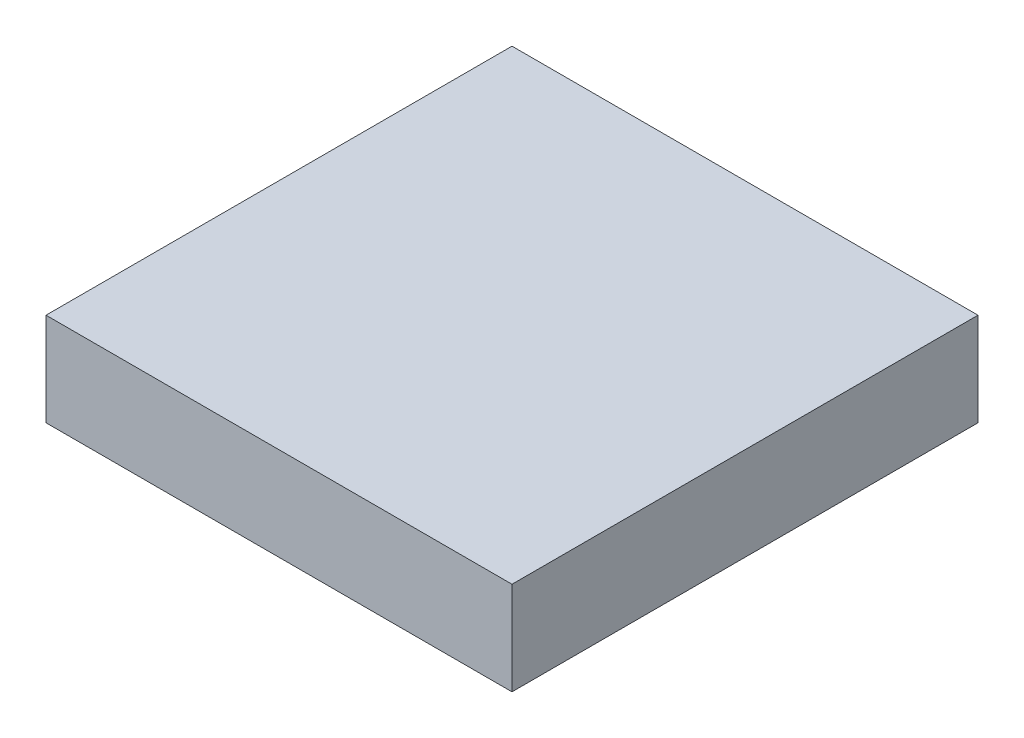
ISO-10303-21;
HEADER;
FILE_DESCRIPTION(('STEP AP214'),'2;1');
FILE_NAME('part.step','',(''),(''),'','','');
FILE_SCHEMA(('AUTOMOTIVE_DESIGN { 1 0 10303 214 1 1 1 1 }'));
ENDSEC;
DATA;
#1=APPLICATION_CONTEXT('core data for automotive mechanical design processes');
#2=APPLICATION_PROTOCOL_DEFINITION('international standard','automotive_design',2000,#1);
#3=PRODUCT_CONTEXT('',#1,'mechanical');
#4=PRODUCT('Part','Part','',(#3));
#5=PRODUCT_RELATED_PRODUCT_CATEGORY('part','',(#4));
#6=PRODUCT_DEFINITION_FORMATION('','',#4);
#7=PRODUCT_DEFINITION_CONTEXT('part definition',#1,'design');
#8=PRODUCT_DEFINITION('design','',#6,#7);
#9=PRODUCT_DEFINITION_SHAPE('','',#8);
#10=(LENGTH_UNIT() NAMED_UNIT(*) SI_UNIT(.MILLI.,.METRE.));
#11=(NAMED_UNIT(*) PLANE_ANGLE_UNIT() SI_UNIT($,.RADIAN.));
#12=(NAMED_UNIT(*) SI_UNIT($,.STERADIAN.) SOLID_ANGLE_UNIT());
#13=UNCERTAINTY_MEASURE_WITH_UNIT(LENGTH_MEASURE(1.E-05),#10,'distance_accuracy_value','');
#14=(GEOMETRIC_REPRESENTATION_CONTEXT(3) GLOBAL_UNCERTAINTY_ASSIGNED_CONTEXT((#13)) GLOBAL_UNIT_ASSIGNED_CONTEXT((#10,
#11,#12)) REPRESENTATION_CONTEXT('',''));
#15=CARTESIAN_POINT('',(0.,0.,0.));
#16=DIRECTION('',(0.,0.,1.));
#17=DIRECTION('',(1.,0.,0.));
#18=AXIS2_PLACEMENT_3D('',#15,#16,#17);
#19=CARTESIAN_POINT('',(0.,-5.,0.));
#20=DIRECTION('',(0.,1.,0.));
#21=DIRECTION('',(0.,0.,1.));
#22=AXIS2_PLACEMENT_3D('',#19,#20,#21);
#23=PLANE('',#22);
#24=CARTESIAN_POINT('',(0.,-5.,0.));
#25=DIRECTION('',(0.,1.,0.));
#26=DIRECTION('',(0.,0.,1.));
#27=AXIS2_PLACEMENT_3D('',#24,#25,#26);
#28=CIRCLE('',#27,2.7);
#29=CARTESIAN_POINT('',(-2.0976176963403,-5.,-1.7));
#30=VERTEX_POINT('',#29);
#31=CARTESIAN_POINT('',(-2.5,-5.,-1.01980390271856));
#32=VERTEX_POINT('',#31);
#33=EDGE_CURVE('E162',#30,#32,#28,.T.);
#34=ORIENTED_EDGE('',*,*,#33,.T.);
#35=DIRECTION('',(0.,0.,-1.));
#36=VECTOR('',#35,1.);
#37=CARTESIAN_POINT('',(-2.5,-5.,0.));
#38=LINE('',#37,#36);
#39=CARTESIAN_POINT('',(-2.5,-5.,-2.5));
#40=VERTEX_POINT('',#39);
#41=EDGE_CURVE('E200',#32,#40,#38,.T.);
#42=ORIENTED_EDGE('',*,*,#41,.T.);
#43=DIRECTION('',(1.,0.,0.));
#44=VECTOR('',#43,1.);
#45=CARTESIAN_POINT('',(7.5,-5.,-2.5));
#46=LINE('',#45,#44);
#47=CARTESIAN_POINT('',(2.5,-5.,-2.5));
#48=VERTEX_POINT('',#47);
#49=EDGE_CURVE('E198',#40,#48,#46,.T.);
#50=ORIENTED_EDGE('',*,*,#49,.T.);
#51=DIRECTION('',(0.,0.,1.));
#52=VECTOR('',#51,1.);
#53=CARTESIAN_POINT('',(2.5,-5.,7.5));
#54=LINE('',#53,#52);
#55=CARTESIAN_POINT('',(2.5,-5.,-1.01980390271856));
#56=VERTEX_POINT('',#55);
#57=EDGE_CURVE('E196',#48,#56,#54,.T.);
#58=ORIENTED_EDGE('',*,*,#57,.T.);
#59=CARTESIAN_POINT('',(2.0976176963403,-5.,-1.7));
#60=VERTEX_POINT('',#59);
#61=EDGE_CURVE('E160',#56,#60,#28,.T.);
#62=ORIENTED_EDGE('',*,*,#61,.T.);
#63=DIRECTION('',(1.,0.,0.));
#64=VECTOR('',#63,1.);
#65=CARTESIAN_POINT('',(0.,-5.,-1.7));
#66=LINE('',#65,#64);
#67=EDGE_CURVE('E164',#30,#60,#66,.T.);
#68=ORIENTED_EDGE('',*,*,#67,.F.);
#69=EDGE_LOOP('',(#34,#42,#50,#58,#62,#68));
#70=FACE_BOUND('',#69,.T.);
#71=ADVANCED_FACE('F38',(#70),#23,.F.);
#72=CARTESIAN_POINT('',(-7.5,-5.,0.));
#73=DIRECTION('',(1.,0.,0.));
#74=DIRECTION('',(0.,0.,-1.));
#75=AXIS2_PLACEMENT_3D('',#72,#73,#74);
#76=PLANE('',#75);
#77=DIRECTION('',(0.,1.,0.));
#78=VECTOR('',#77,1.);
#79=CARTESIAN_POINT('',(-7.5,-5.,-7.5));
#80=LINE('',#79,#78);
#81=CARTESIAN_POINT('',(-7.5,0.,-7.5));
#82=VERTEX_POINT('',#81);
#83=CARTESIAN_POINT('',(-7.5,3.,-7.5));
#84=VERTEX_POINT('',#83);
#85=EDGE_CURVE('E175',#82,#84,#80,.T.);
#86=ORIENTED_EDGE('',*,*,#85,.F.);
#87=DIRECTION('',(0.,0.,1.));
#88=VECTOR('',#87,1.);
#89=CARTESIAN_POINT('',(-7.5,0.,0.));
#90=LINE('',#89,#88);
#91=CARTESIAN_POINT('',(-7.5,0.,7.5));
#92=VERTEX_POINT('',#91);
#93=EDGE_CURVE('E134',#82,#92,#90,.T.);
#94=ORIENTED_EDGE('',*,*,#93,.T.);
#95=DIRECTION('',(0.,1.,0.));
#96=VECTOR('',#95,1.);
#97=CARTESIAN_POINT('',(-7.5,-5.,7.5));
#98=LINE('',#97,#96);
#99=CARTESIAN_POINT('',(-7.5,3.,7.5));
#100=VERTEX_POINT('',#99);
#101=EDGE_CURVE('E128',#92,#100,#98,.T.);
#102=ORIENTED_EDGE('',*,*,#101,.T.);
#103=DIRECTION('',(0.,0.,-1.));
#104=VECTOR('',#103,1.);
#105=CARTESIAN_POINT('',(-7.5,3.,0.));
#106=LINE('',#105,#104);
#107=EDGE_CURVE('E132',#100,#84,#106,.T.);
#108=ORIENTED_EDGE('',*,*,#107,.T.);
#109=EDGE_LOOP('',(#86,#94,#102,#108));
#110=FACE_BOUND('',#109,.T.);
#111=ADVANCED_FACE('F131',(#110),#76,.F.);
#112=CARTESIAN_POINT('',(0.,-5.,-7.5));
#113=DIRECTION('',(0.,0.,-1.));
#114=DIRECTION('',(-1.,0.,0.));
#115=AXIS2_PLACEMENT_3D('',#112,#113,#114);
#116=PLANE('',#115);
#117=DIRECTION('',(0.,1.,0.));
#118=VECTOR('',#117,1.);
#119=CARTESIAN_POINT('',(7.5,-5.,-7.5));
#120=LINE('',#119,#118);
#121=CARTESIAN_POINT('',(7.5,0.,-7.5));
#122=VERTEX_POINT('',#121);
#123=CARTESIAN_POINT('',(7.5,3.,-7.5));
#124=VERTEX_POINT('',#123);
#125=EDGE_CURVE('E178',#122,#124,#120,.T.);
#126=ORIENTED_EDGE('',*,*,#125,.F.);
#127=DIRECTION('',(-1.,0.,0.));
#128=VECTOR('',#127,1.);
#129=CARTESIAN_POINT('',(-7.5,0.,-7.5));
#130=LINE('',#129,#128);
#131=EDGE_CURVE('E205',#122,#82,#130,.T.);
#132=ORIENTED_EDGE('',*,*,#131,.T.);
#133=ORIENTED_EDGE('',*,*,#85,.T.);
#134=DIRECTION('',(-1.,0.,0.));
#135=VECTOR('',#134,1.);
#136=CARTESIAN_POINT('',(0.,3.,-7.5));
#137=LINE('',#136,#135);
#138=EDGE_CURVE('E146',#124,#84,#137,.T.);
#139=ORIENTED_EDGE('',*,*,#138,.F.);
#140=EDGE_LOOP('',(#126,#132,#133,#139));
#141=FACE_BOUND('',#140,.T.);
#142=ADVANCED_FACE('F232',(#141),#116,.T.);
#143=CARTESIAN_POINT('',(7.5,-5.,0.));
#144=DIRECTION('',(1.,0.,0.));
#145=DIRECTION('',(0.,0.,-1.));
#146=AXIS2_PLACEMENT_3D('',#143,#144,#145);
#147=PLANE('',#146);
#148=DIRECTION('',(0.,1.,0.));
#149=VECTOR('',#148,1.);
#150=CARTESIAN_POINT('',(7.5,-5.,7.5));
#151=LINE('',#150,#149);
#152=CARTESIAN_POINT('',(7.5,0.,7.5));
#153=VERTEX_POINT('',#152);
#154=CARTESIAN_POINT('',(7.5,3.,7.5));
#155=VERTEX_POINT('',#154);
#156=EDGE_CURVE('E136',#153,#155,#151,.T.);
#157=ORIENTED_EDGE('',*,*,#156,.F.);
#158=DIRECTION('',(0.,0.,-1.));
#159=VECTOR('',#158,1.);
#160=CARTESIAN_POINT('',(7.5,0.,-7.5));
#161=LINE('',#160,#159);
#162=EDGE_CURVE('E60',#153,#122,#161,.T.);
#163=ORIENTED_EDGE('',*,*,#162,.T.);
#164=ORIENTED_EDGE('',*,*,#125,.T.);
#165=DIRECTION('',(0.,0.,-1.));
#166=VECTOR('',#165,1.);
#167=CARTESIAN_POINT('',(7.5,3.,0.));
#168=LINE('',#167,#166);
#169=EDGE_CURVE('E150',#155,#124,#168,.T.);
#170=ORIENTED_EDGE('',*,*,#169,.F.);
#171=EDGE_LOOP('',(#157,#163,#164,#170));
#172=FACE_BOUND('',#171,.T.);
#173=ADVANCED_FACE('F279',(#172),#147,.T.);
#174=CARTESIAN_POINT('',(0.,-5.,0.));
#175=DIRECTION('',(0.,1.,0.));
#176=DIRECTION('',(0.,0.,1.));
#177=AXIS2_PLACEMENT_3D('',#174,#175,#176);
#178=CYLINDRICAL_SURFACE('',#177,2.7);
#179=ORIENTED_EDGE('',*,*,#61,.F.);
#180=CARTESIAN_POINT('',(0.,-7.50000000000001,0.));
#181=DIRECTION('',(0.707106781186549,-0.707106781186546,0.));
#182=DIRECTION('',(0.707106781186546,0.707106781186549,0.));
#183=AXIS2_PLACEMENT_3D('',#180,#181,#182);
#184=ELLIPSE('',#183,3.81837661840736,2.7);
#185=CARTESIAN_POINT('',(2.5,-5.,1.01980390271856));
#186=VERTEX_POINT('',#185);
#187=EDGE_CURVE('E47',#56,#186,#184,.T.);
#188=ORIENTED_EDGE('',*,*,#187,.T.);
#189=CARTESIAN_POINT('',(2.0976176963403,-5.,1.7));
#190=VERTEX_POINT('',#189);
#191=EDGE_CURVE('E156',#190,#186,#28,.T.);
#192=ORIENTED_EDGE('',*,*,#191,.F.);
#193=DIRECTION('',(0.,1.,0.));
#194=VECTOR('',#193,1.);
#195=CARTESIAN_POINT('',(2.0976176963403,-5.,1.7));
#196=LINE('',#195,#194);
#197=CARTESIAN_POINT('',(2.0976176963403,0.,1.7));
#198=VERTEX_POINT('',#197);
#199=EDGE_CURVE('E167',#190,#198,#196,.T.);
#200=ORIENTED_EDGE('',*,*,#199,.T.);
#201=CARTESIAN_POINT('',(0.,0.,0.));
#202=DIRECTION('',(0.,1.,0.));
#203=DIRECTION('',(0.,0.,1.));
#204=AXIS2_PLACEMENT_3D('',#201,#202,#203);
#205=CIRCLE('',#204,2.7);
#206=CARTESIAN_POINT('',(2.0976176963403,0.,-1.7));
#207=VERTEX_POINT('',#206);
#208=EDGE_CURVE('E155',#198,#207,#205,.T.);
#209=ORIENTED_EDGE('',*,*,#208,.T.);
#210=DIRECTION('',(0.,1.,0.));
#211=VECTOR('',#210,1.);
#212=CARTESIAN_POINT('',(2.0976176963403,-5.,-1.7));
#213=LINE('',#212,#211);
#214=EDGE_CURVE('E137',#60,#207,#213,.T.);
#215=ORIENTED_EDGE('',*,*,#214,.F.);
#216=EDGE_LOOP('',(#179,#188,#192,#200,#209,#215));
#217=FACE_BOUND('',#216,.T.);
#218=ADVANCED_FACE('F251',(#217),#178,.F.);
#219=CARTESIAN_POINT('',(0.,-5.,-1.7));
#220=DIRECTION('',(0.,0.,1.));
#221=DIRECTION('',(1.,0.,0.));
#222=AXIS2_PLACEMENT_3D('',#219,#220,#221);
#223=PLANE('',#222);
#224=DIRECTION('',(1.,0.,0.));
#225=VECTOR('',#224,1.);
#226=CARTESIAN_POINT('',(0.,0.,-1.7));
#227=LINE('',#226,#225);
#228=CARTESIAN_POINT('',(-2.0976176963403,0.,-1.7));
#229=VERTEX_POINT('',#228);
#230=EDGE_CURVE('E172',#229,#207,#227,.T.);
#231=ORIENTED_EDGE('',*,*,#230,.F.);
#232=DIRECTION('',(0.,1.,0.));
#233=VECTOR('',#232,1.);
#234=CARTESIAN_POINT('',(-2.0976176963403,-5.,-1.7));
#235=LINE('',#234,#233);
#236=EDGE_CURVE('E183',#30,#229,#235,.T.);
#237=ORIENTED_EDGE('',*,*,#236,.F.);
#238=ORIENTED_EDGE('',*,*,#67,.T.);
#239=ORIENTED_EDGE('',*,*,#214,.T.);
#240=EDGE_LOOP('',(#231,#237,#238,#239));
#241=FACE_BOUND('',#240,.T.);
#242=ADVANCED_FACE('F255',(#241),#223,.T.);
#243=CARTESIAN_POINT('',(-2.5,-5.,1.01980390271856));
#244=VERTEX_POINT('',#243);
#245=CARTESIAN_POINT('',(-2.0976176963403,-5.,1.7));
#246=VERTEX_POINT('',#245);
#247=EDGE_CURVE('E161',#244,#246,#28,.T.);
#248=ORIENTED_EDGE('',*,*,#247,.F.);
#249=CARTESIAN_POINT('',(0.,-7.50000000000001,0.));
#250=DIRECTION('',(0.707106781186549,0.707106781186546,0.));
#251=DIRECTION('',(-0.707106781186546,0.707106781186549,0.));
#252=AXIS2_PLACEMENT_3D('',#249,#250,#251);
#253=ELLIPSE('',#252,3.81837661840736,2.7);
#254=EDGE_CURVE('E202',#244,#32,#253,.F.);
#255=ORIENTED_EDGE('',*,*,#254,.T.);
#256=ORIENTED_EDGE('',*,*,#33,.F.);
#257=ORIENTED_EDGE('',*,*,#236,.T.);
#258=CARTESIAN_POINT('',(-2.0976176963403,0.,1.7));
#259=VERTEX_POINT('',#258);
#260=EDGE_CURVE('E170',#229,#259,#205,.T.);
#261=ORIENTED_EDGE('',*,*,#260,.T.);
#262=DIRECTION('',(0.,1.,0.));
#263=VECTOR('',#262,1.);
#264=CARTESIAN_POINT('',(-2.0976176963403,-5.,1.7));
#265=LINE('',#264,#263);
#266=EDGE_CURVE('E185',#246,#259,#265,.T.);
#267=ORIENTED_EDGE('',*,*,#266,.F.);
#268=EDGE_LOOP('',(#248,#255,#256,#257,#261,#267));
#269=FACE_BOUND('',#268,.T.);
#270=ADVANCED_FACE('F242',(#269),#178,.F.);
#271=CARTESIAN_POINT('',(0.,-5.,1.7));
#272=DIRECTION('',(0.,0.,1.));
#273=DIRECTION('',(1.,0.,0.));
#274=AXIS2_PLACEMENT_3D('',#271,#272,#273);
#275=PLANE('',#274);
#276=DIRECTION('',(1.,0.,0.));
#277=VECTOR('',#276,1.);
#278=CARTESIAN_POINT('',(0.,0.,1.7));
#279=LINE('',#278,#277);
#280=EDGE_CURVE('E169',#259,#198,#279,.T.);
#281=ORIENTED_EDGE('',*,*,#280,.T.);
#282=ORIENTED_EDGE('',*,*,#199,.F.);
#283=DIRECTION('',(1.,0.,0.));
#284=VECTOR('',#283,1.);
#285=CARTESIAN_POINT('',(0.,-5.,1.7));
#286=LINE('',#285,#284);
#287=EDGE_CURVE('E159',#246,#190,#286,.T.);
#288=ORIENTED_EDGE('',*,*,#287,.F.);
#289=ORIENTED_EDGE('',*,*,#266,.T.);
#290=EDGE_LOOP('',(#281,#282,#288,#289));
#291=FACE_BOUND('',#290,.T.);
#292=ADVANCED_FACE('F260',(#291),#275,.F.);
#293=CARTESIAN_POINT('',(0.,-5.,7.5));
#294=DIRECTION('',(0.,0.,-1.));
#295=DIRECTION('',(-1.,0.,0.));
#296=AXIS2_PLACEMENT_3D('',#293,#294,#295);
#297=PLANE('',#296);
#298=ORIENTED_EDGE('',*,*,#101,.F.);
#299=DIRECTION('',(1.,0.,0.));
#300=VECTOR('',#299,1.);
#301=CARTESIAN_POINT('',(0.,0.,7.5));
#302=LINE('',#301,#300);
#303=EDGE_CURVE('E11',#92,#153,#302,.T.);
#304=ORIENTED_EDGE('',*,*,#303,.T.);
#305=ORIENTED_EDGE('',*,*,#156,.T.);
#306=DIRECTION('',(-1.,0.,0.));
#307=VECTOR('',#306,1.);
#308=CARTESIAN_POINT('',(0.,3.,7.5));
#309=LINE('',#308,#307);
#310=EDGE_CURVE('E144',#155,#100,#309,.T.);
#311=ORIENTED_EDGE('',*,*,#310,.T.);
#312=EDGE_LOOP('',(#298,#304,#305,#311));
#313=FACE_BOUND('',#312,.T.);
#314=ADVANCED_FACE('F148',(#313),#297,.F.);
#315=DIRECTION('',(-1.,0.,0.));
#316=VECTOR('',#315,1.);
#317=CARTESIAN_POINT('',(0.,-5.,2.5));
#318=LINE('',#317,#316);
#319=CARTESIAN_POINT('',(2.5,-5.,2.5));
#320=VERTEX_POINT('',#319);
#321=CARTESIAN_POINT('',(-2.5,-5.,2.5));
#322=VERTEX_POINT('',#321);
#323=EDGE_CURVE('E177',#320,#322,#318,.T.);
#324=ORIENTED_EDGE('',*,*,#323,.T.);
#325=DIRECTION('',(0.,0.,-1.));
#326=VECTOR('',#325,1.);
#327=CARTESIAN_POINT('',(-2.5,-5.,0.));
#328=LINE('',#327,#326);
#329=EDGE_CURVE('E193',#322,#244,#328,.T.);
#330=ORIENTED_EDGE('',*,*,#329,.T.);
#331=ORIENTED_EDGE('',*,*,#247,.T.);
#332=ORIENTED_EDGE('',*,*,#287,.T.);
#333=ORIENTED_EDGE('',*,*,#191,.T.);
#334=DIRECTION('',(0.,0.,1.));
#335=VECTOR('',#334,1.);
#336=CARTESIAN_POINT('',(2.5,-5.,7.5));
#337=LINE('',#336,#335);
#338=EDGE_CURVE('E191',#186,#320,#337,.T.);
#339=ORIENTED_EDGE('',*,*,#338,.T.);
#340=EDGE_LOOP('',(#324,#330,#331,#332,#333,#339));
#341=FACE_BOUND('',#340,.T.);
#342=ADVANCED_FACE('F239',(#341),#23,.F.);
#343=CARTESIAN_POINT('',(0.,0.,0.));
#344=DIRECTION('',(0.,1.,0.));
#345=DIRECTION('',(0.,0.,1.));
#346=AXIS2_PLACEMENT_3D('',#343,#344,#345);
#347=PLANE('',#346);
#348=ORIENTED_EDGE('',*,*,#208,.F.);
#349=ORIENTED_EDGE('',*,*,#280,.F.);
#350=ORIENTED_EDGE('',*,*,#260,.F.);
#351=ORIENTED_EDGE('',*,*,#230,.T.);
#352=EDGE_LOOP('',(#348,#349,#350,#351));
#353=FACE_BOUND('',#352,.T.);
#354=ADVANCED_FACE('F262',(#353),#347,.F.);
#355=CARTESIAN_POINT('',(0.,3.,0.));
#356=DIRECTION('',(0.,1.,0.));
#357=DIRECTION('',(0.,0.,1.));
#358=AXIS2_PLACEMENT_3D('',#355,#356,#357);
#359=PLANE('',#358);
#360=ORIENTED_EDGE('',*,*,#107,.F.);
#361=ORIENTED_EDGE('',*,*,#310,.F.);
#362=ORIENTED_EDGE('',*,*,#169,.T.);
#363=ORIENTED_EDGE('',*,*,#138,.T.);
#364=EDGE_LOOP('',(#360,#361,#362,#363));
#365=FACE_BOUND('',#364,.T.);
#366=ADVANCED_FACE('F142',(#365),#359,.T.);
#367=CARTESIAN_POINT('',(7.5,0.,0.));
#368=DIRECTION('',(0.707106781186549,-0.707106781186546,0.));
#369=DIRECTION('',(0.,0.,1.));
#370=AXIS2_PLACEMENT_3D('',#367,#368,#369);
#371=PLANE('',#370);
#372=DIRECTION('',(0.577350269189625,0.577350269189627,-0.577350269189625));
#373=VECTOR('',#372,1.);
#374=CARTESIAN_POINT('',(5.,-2.49999999999998,-5.00000000000001));
#375=LINE('',#374,#373);
#376=EDGE_CURVE('E213',#122,#48,#375,.F.);
#377=ORIENTED_EDGE('',*,*,#376,.F.);
#378=ORIENTED_EDGE('',*,*,#162,.F.);
#379=DIRECTION('',(-0.577350269189625,-0.577350269189627,-0.577350269189625));
#380=VECTOR('',#379,1.);
#381=CARTESIAN_POINT('',(1.66666666666667,-5.83333333333333,1.66666666666667));
#382=LINE('',#381,#380);
#383=EDGE_CURVE('E42',#320,#153,#382,.F.);
#384=ORIENTED_EDGE('',*,*,#383,.F.);
#385=ORIENTED_EDGE('',*,*,#338,.F.);
#386=ORIENTED_EDGE('',*,*,#187,.F.);
#387=ORIENTED_EDGE('',*,*,#57,.F.);
#388=EDGE_LOOP('',(#377,#378,#384,#385,#386,#387));
#389=FACE_BOUND('',#388,.T.);
#390=ADVANCED_FACE('F40',(#389),#371,.T.);
#391=CARTESIAN_POINT('',(0.,-5.,2.5));
#392=DIRECTION('',(0.,0.707106781186546,-0.707106781186549));
#393=DIRECTION('',(-1.,0.,0.));
#394=AXIS2_PLACEMENT_3D('',#391,#392,#393);
#395=PLANE('',#394);
#396=ORIENTED_EDGE('',*,*,#383,.T.);
#397=ORIENTED_EDGE('',*,*,#303,.F.);
#398=DIRECTION('',(0.577350269189625,-0.577350269189627,-0.577350269189625));
#399=VECTOR('',#398,1.);
#400=CARTESIAN_POINT('',(-1.66666666666667,-5.83333333333333,1.66666666666667));
#401=LINE('',#400,#399);
#402=EDGE_CURVE('E212',#322,#92,#401,.F.);
#403=ORIENTED_EDGE('',*,*,#402,.F.);
#404=ORIENTED_EDGE('',*,*,#323,.F.);
#405=EDGE_LOOP('',(#396,#397,#403,#404));
#406=FACE_BOUND('',#405,.T.);
#407=ADVANCED_FACE('F223',(#406),#395,.F.);
#408=CARTESIAN_POINT('',(0.,0.,-7.5));
#409=DIRECTION('',(0.,-0.707106781186546,-0.707106781186549));
#410=DIRECTION('',(1.,0.,0.));
#411=AXIS2_PLACEMENT_3D('',#408,#409,#410);
#412=PLANE('',#411);
#413=ORIENTED_EDGE('',*,*,#376,.T.);
#414=ORIENTED_EDGE('',*,*,#49,.F.);
#415=DIRECTION('',(0.577350269189625,-0.577350269189627,0.577350269189625));
#416=VECTOR('',#415,1.);
#417=CARTESIAN_POINT('',(-5.00000000000001,-2.49999999999998,-5.));
#418=LINE('',#417,#416);
#419=EDGE_CURVE('E209',#82,#40,#418,.T.);
#420=ORIENTED_EDGE('',*,*,#419,.F.);
#421=ORIENTED_EDGE('',*,*,#131,.F.);
#422=EDGE_LOOP('',(#413,#414,#420,#421));
#423=FACE_BOUND('',#422,.T.);
#424=ADVANCED_FACE('F230',(#423),#412,.T.);
#425=CARTESIAN_POINT('',(-2.5,-5.,0.));
#426=DIRECTION('',(0.707106781186549,0.707106781186546,0.));
#427=DIRECTION('',(0.,0.,-1.));
#428=AXIS2_PLACEMENT_3D('',#425,#426,#427);
#429=PLANE('',#428);
#430=ORIENTED_EDGE('',*,*,#402,.T.);
#431=ORIENTED_EDGE('',*,*,#93,.F.);
#432=ORIENTED_EDGE('',*,*,#419,.T.);
#433=ORIENTED_EDGE('',*,*,#41,.F.);
#434=ORIENTED_EDGE('',*,*,#254,.F.);
#435=ORIENTED_EDGE('',*,*,#329,.F.);
#436=EDGE_LOOP('',(#430,#431,#432,#433,#434,#435));
#437=FACE_BOUND('',#436,.T.);
#438=ADVANCED_FACE('F234',(#437),#429,.F.);
#439=CLOSED_SHELL('',(#71,#111,#142,#173,#218,#242,#270,#292,#314,#342,#354,#366,#390,#407,#424,#438));
#440=MANIFOLD_SOLID_BREP('B2',#439);
#441=ADVANCED_BREP_SHAPE_REPRESENTATION('',(#18,#440),#14);
#442=SHAPE_DEFINITION_REPRESENTATION(#9,#441);
ENDSEC;
END-ISO-10303-21;
